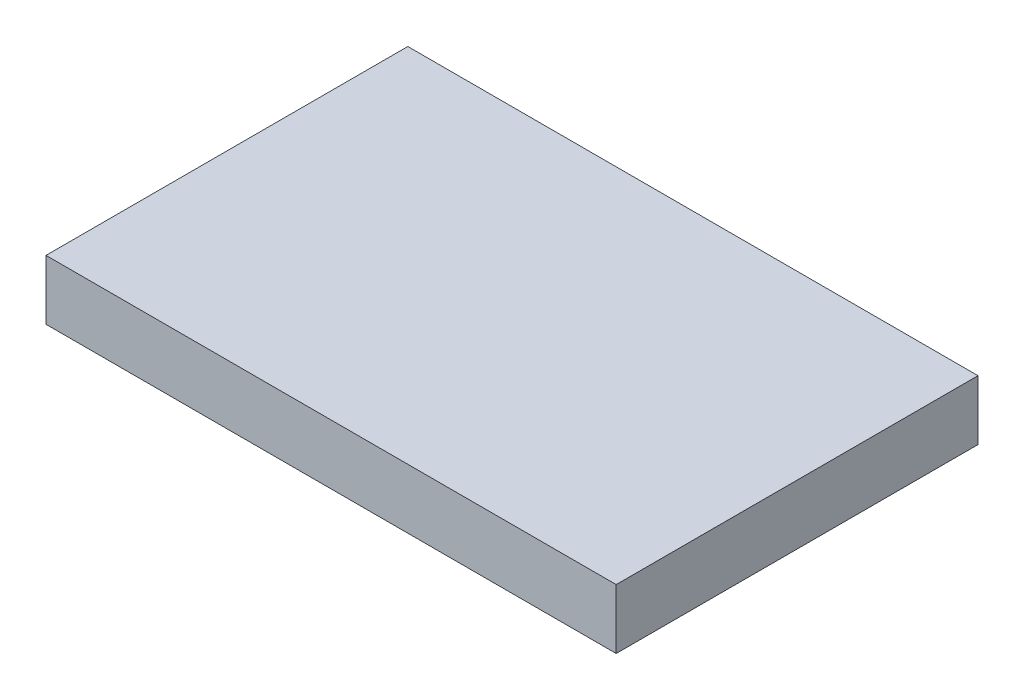
ISO-10303-21;
HEADER;
FILE_DESCRIPTION(('STEP AP214'),'2;1');
FILE_NAME('part.step','',(''),(''),'','','');
FILE_SCHEMA(('AUTOMOTIVE_DESIGN { 1 0 10303 214 1 1 1 1 }'));
ENDSEC;
DATA;
#1=APPLICATION_CONTEXT('core data for automotive mechanical design processes');
#2=APPLICATION_PROTOCOL_DEFINITION('international standard','automotive_design',2000,#1);
#3=PRODUCT_CONTEXT('',#1,'mechanical');
#4=PRODUCT('Part','Part','',(#3));
#5=PRODUCT_RELATED_PRODUCT_CATEGORY('part','',(#4));
#6=PRODUCT_DEFINITION_FORMATION('','',#4);
#7=PRODUCT_DEFINITION_CONTEXT('part definition',#1,'design');
#8=PRODUCT_DEFINITION('design','',#6,#7);
#9=PRODUCT_DEFINITION_SHAPE('','',#8);
#10=(LENGTH_UNIT() NAMED_UNIT(*) SI_UNIT(.MILLI.,.METRE.));
#11=(NAMED_UNIT(*) PLANE_ANGLE_UNIT() SI_UNIT($,.RADIAN.));
#12=(NAMED_UNIT(*) SI_UNIT($,.STERADIAN.) SOLID_ANGLE_UNIT());
#13=UNCERTAINTY_MEASURE_WITH_UNIT(LENGTH_MEASURE(1.E-05),#10,'distance_accuracy_value','');
#14=(GEOMETRIC_REPRESENTATION_CONTEXT(3) GLOBAL_UNCERTAINTY_ASSIGNED_CONTEXT((#13)) GLOBAL_UNIT_ASSIGNED_CONTEXT((#10,
#11,#12)) REPRESENTATION_CONTEXT('',''));
#15=CARTESIAN_POINT('',(0.,0.,0.));
#16=DIRECTION('',(0.,0.,1.));
#17=DIRECTION('',(1.,0.,0.));
#18=AXIS2_PLACEMENT_3D('',#15,#16,#17);
#19=CARTESIAN_POINT('',(-1237.11719454961,573.716849489796,1817.97));
#20=DIRECTION('',(1.,0.,0.));
#21=DIRECTION('',(0.,0.,-1.));
#22=AXIS2_PLACEMENT_3D('',#19,#20,#21);
#23=PLANE('',#22);
#24=DIRECTION('',(0.,-1.,0.));
#25=VECTOR('',#24,1.);
#26=CARTESIAN_POINT('',(-1237.11719454961,573.716849489796,0.));
#27=LINE('',#26,#25);
#28=CARTESIAN_POINT('',(-1237.11719454961,573.716849489796,0.));
#29=VERTEX_POINT('',#28);
#30=CARTESIAN_POINT('',(-1237.11719454961,273.716849489801,0.));
#31=VERTEX_POINT('',#30);
#32=EDGE_CURVE('E107',#29,#31,#27,.T.);
#33=ORIENTED_EDGE('',*,*,#32,.T.);
#34=DIRECTION('',(0.,0.,-1.));
#35=VECTOR('',#34,1.);
#36=CARTESIAN_POINT('',(-1237.11719454961,273.716849489801,1817.97));
#37=LINE('',#36,#35);
#38=CARTESIAN_POINT('',(-1237.11719454961,273.716849489801,1817.97));
#39=VERTEX_POINT('',#38);
#40=EDGE_CURVE('E11',#39,#31,#37,.T.);
#41=ORIENTED_EDGE('',*,*,#40,.F.);
#42=DIRECTION('',(0.,-1.,0.));
#43=VECTOR('',#42,1.);
#44=CARTESIAN_POINT('',(-1237.11719454961,573.716849489796,1817.97));
#45=LINE('',#44,#43);
#46=CARTESIAN_POINT('',(-1237.11719454961,573.716849489796,1817.97));
#47=VERTEX_POINT('',#46);
#48=EDGE_CURVE('E91',#47,#39,#45,.T.);
#49=ORIENTED_EDGE('',*,*,#48,.F.);
#50=DIRECTION('',(0.,0.,-1.));
#51=VECTOR('',#50,1.);
#52=CARTESIAN_POINT('',(-1237.11719454961,573.716849489796,1817.97));
#53=LINE('',#52,#51);
#54=EDGE_CURVE('E103',#47,#29,#53,.T.);
#55=ORIENTED_EDGE('',*,*,#54,.T.);
#56=EDGE_LOOP('',(#33,#41,#49,#55));
#57=FACE_BOUND('',#56,.T.);
#58=ADVANCED_FACE('F39',(#57),#23,.F.);
#59=CARTESIAN_POINT('',(-1237.11719454961,273.716849489801,1817.97));
#60=DIRECTION('',(0.,1.,0.));
#61=DIRECTION('',(0.,0.,1.));
#62=AXIS2_PLACEMENT_3D('',#59,#60,#61);
#63=PLANE('',#62);
#64=DIRECTION('',(1.,0.,0.));
#65=VECTOR('',#64,1.);
#66=CARTESIAN_POINT('',(-1237.11719454961,273.716849489801,0.));
#67=LINE('',#66,#65);
#68=CARTESIAN_POINT('',(1627.81280545039,273.716849489801,0.));
#69=VERTEX_POINT('',#68);
#70=EDGE_CURVE('E96',#31,#69,#67,.T.);
#71=ORIENTED_EDGE('',*,*,#70,.T.);
#72=DIRECTION('',(0.,0.,-1.));
#73=VECTOR('',#72,1.);
#74=CARTESIAN_POINT('',(1627.81280545039,273.716849489801,1817.97));
#75=LINE('',#74,#73);
#76=CARTESIAN_POINT('',(1627.81280545039,273.716849489801,1817.97));
#77=VERTEX_POINT('',#76);
#78=EDGE_CURVE('E48',#77,#69,#75,.T.);
#79=ORIENTED_EDGE('',*,*,#78,.F.);
#80=DIRECTION('',(1.,0.,0.));
#81=VECTOR('',#80,1.);
#82=CARTESIAN_POINT('',(-1237.11719454961,273.716849489801,1817.97));
#83=LINE('',#82,#81);
#84=EDGE_CURVE('E86',#39,#77,#83,.T.);
#85=ORIENTED_EDGE('',*,*,#84,.F.);
#86=ORIENTED_EDGE('',*,*,#40,.T.);
#87=EDGE_LOOP('',(#71,#79,#85,#86));
#88=FACE_BOUND('',#87,.T.);
#89=ADVANCED_FACE('F95',(#88),#63,.F.);
#90=CARTESIAN_POINT('',(1627.81280545039,573.716849489796,1817.97));
#91=DIRECTION('',(-1.,0.,0.));
#92=DIRECTION('',(0.,0.,1.));
#93=AXIS2_PLACEMENT_3D('',#90,#91,#92);
#94=PLANE('',#93);
#95=DIRECTION('',(0.,1.,0.));
#96=VECTOR('',#95,1.);
#97=CARTESIAN_POINT('',(1627.81280545039,573.716849489796,0.));
#98=LINE('',#97,#96);
#99=CARTESIAN_POINT('',(1627.81280545039,573.716849489796,0.));
#100=VERTEX_POINT('',#99);
#101=EDGE_CURVE('E73',#69,#100,#98,.T.);
#102=ORIENTED_EDGE('',*,*,#101,.T.);
#103=DIRECTION('',(0.,0.,-1.));
#104=VECTOR('',#103,1.);
#105=CARTESIAN_POINT('',(1627.81280545039,573.716849489796,1817.97));
#106=LINE('',#105,#104);
#107=CARTESIAN_POINT('',(1627.81280545039,573.716849489796,1817.97));
#108=VERTEX_POINT('',#107);
#109=EDGE_CURVE('E98',#108,#100,#106,.T.);
#110=ORIENTED_EDGE('',*,*,#109,.F.);
#111=DIRECTION('',(0.,1.,0.));
#112=VECTOR('',#111,1.);
#113=CARTESIAN_POINT('',(1627.81280545039,573.716849489796,1817.97));
#114=LINE('',#113,#112);
#115=EDGE_CURVE('E89',#77,#108,#114,.T.);
#116=ORIENTED_EDGE('',*,*,#115,.F.);
#117=ORIENTED_EDGE('',*,*,#78,.T.);
#118=EDGE_LOOP('',(#102,#110,#116,#117));
#119=FACE_BOUND('',#118,.T.);
#120=ADVANCED_FACE('F99',(#119),#94,.F.);
#121=CARTESIAN_POINT('',(-1237.11719454961,573.716849489796,1817.97));
#122=DIRECTION('',(0.,-1.,0.));
#123=DIRECTION('',(0.,0.,-1.));
#124=AXIS2_PLACEMENT_3D('',#121,#122,#123);
#125=PLANE('',#124);
#126=DIRECTION('',(-1.,0.,0.));
#127=VECTOR('',#126,1.);
#128=CARTESIAN_POINT('',(-1237.11719454961,573.716849489796,0.));
#129=LINE('',#128,#127);
#130=EDGE_CURVE('E79',#100,#29,#129,.T.);
#131=ORIENTED_EDGE('',*,*,#130,.T.);
#132=ORIENTED_EDGE('',*,*,#54,.F.);
#133=DIRECTION('',(-1.,0.,0.));
#134=VECTOR('',#133,1.);
#135=CARTESIAN_POINT('',(-1237.11719454961,573.716849489796,1817.97));
#136=LINE('',#135,#134);
#137=EDGE_CURVE('E56',#108,#47,#136,.T.);
#138=ORIENTED_EDGE('',*,*,#137,.F.);
#139=ORIENTED_EDGE('',*,*,#109,.T.);
#140=EDGE_LOOP('',(#131,#132,#138,#139));
#141=FACE_BOUND('',#140,.T.);
#142=ADVANCED_FACE('F120',(#141),#125,.F.);
#143=CARTESIAN_POINT('',(0.,0.,1817.97));
#144=DIRECTION('',(0.,0.,1.));
#145=DIRECTION('',(1.,0.,0.));
#146=AXIS2_PLACEMENT_3D('',#143,#144,#145);
#147=PLANE('',#146);
#148=ORIENTED_EDGE('',*,*,#48,.T.);
#149=ORIENTED_EDGE('',*,*,#84,.T.);
#150=ORIENTED_EDGE('',*,*,#115,.T.);
#151=ORIENTED_EDGE('',*,*,#137,.T.);
#152=EDGE_LOOP('',(#148,#149,#150,#151));
#153=FACE_BOUND('',#152,.T.);
#154=ADVANCED_FACE('F87',(#153),#147,.T.);
#155=CARTESIAN_POINT('',(0.,0.,0.));
#156=DIRECTION('',(0.,0.,1.));
#157=DIRECTION('',(1.,0.,0.));
#158=AXIS2_PLACEMENT_3D('',#155,#156,#157);
#159=PLANE('',#158);
#160=ORIENTED_EDGE('',*,*,#32,.F.);
#161=ORIENTED_EDGE('',*,*,#130,.F.);
#162=ORIENTED_EDGE('',*,*,#101,.F.);
#163=ORIENTED_EDGE('',*,*,#70,.F.);
#164=EDGE_LOOP('',(#160,#161,#162,#163));
#165=FACE_BOUND('',#164,.T.);
#166=ADVANCED_FACE('F123',(#165),#159,.F.);
#167=CLOSED_SHELL('',(#58,#89,#120,#142,#154,#166));
#168=MANIFOLD_SOLID_BREP('B2',#167);
#169=ADVANCED_BREP_SHAPE_REPRESENTATION('',(#18,#168),#14);
#170=SHAPE_DEFINITION_REPRESENTATION(#9,#169);
ENDSEC;
END-ISO-10303-21;
